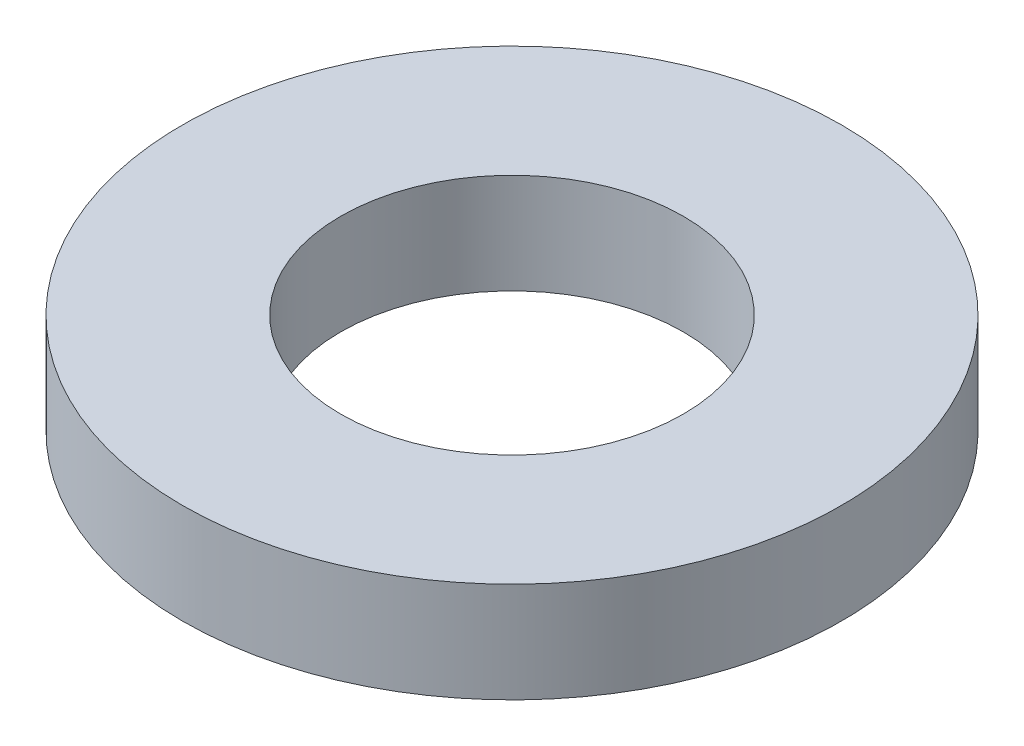
ISO-10303-21;
HEADER;
FILE_DESCRIPTION(('STEP AP214'),'2;1');
FILE_NAME('part.step','',(''),(''),'','','');
FILE_SCHEMA(('AUTOMOTIVE_DESIGN { 1 0 10303 214 1 1 1 1 }'));
ENDSEC;
DATA;
#1=APPLICATION_CONTEXT('core data for automotive mechanical design processes');
#2=APPLICATION_PROTOCOL_DEFINITION('international standard','automotive_design',2000,#1);
#3=PRODUCT_CONTEXT('',#1,'mechanical');
#4=PRODUCT('Part','Part','',(#3));
#5=PRODUCT_RELATED_PRODUCT_CATEGORY('part','',(#4));
#6=PRODUCT_DEFINITION_FORMATION('','',#4);
#7=PRODUCT_DEFINITION_CONTEXT('part definition',#1,'design');
#8=PRODUCT_DEFINITION('design','',#6,#7);
#9=PRODUCT_DEFINITION_SHAPE('','',#8);
#10=(LENGTH_UNIT() NAMED_UNIT(*) SI_UNIT(.MILLI.,.METRE.));
#11=(NAMED_UNIT(*) PLANE_ANGLE_UNIT() SI_UNIT($,.RADIAN.));
#12=(NAMED_UNIT(*) SI_UNIT($,.STERADIAN.) SOLID_ANGLE_UNIT());
#13=UNCERTAINTY_MEASURE_WITH_UNIT(LENGTH_MEASURE(1.E-05),#10,'distance_accuracy_value','');
#14=(GEOMETRIC_REPRESENTATION_CONTEXT(3) GLOBAL_UNCERTAINTY_ASSIGNED_CONTEXT((#13)) GLOBAL_UNIT_ASSIGNED_CONTEXT((#10,
#11,#12)) REPRESENTATION_CONTEXT('',''));
#15=CARTESIAN_POINT('',(0.,0.,0.));
#16=DIRECTION('',(0.,0.,1.));
#17=DIRECTION('',(1.,0.,0.));
#18=AXIS2_PLACEMENT_3D('',#15,#16,#17);
#19=CARTESIAN_POINT('',(0.,19.,0.));
#20=DIRECTION('',(0.,-1.,0.));
#21=DIRECTION('',(0.,0.,-1.));
#22=AXIS2_PLACEMENT_3D('',#19,#20,#21);
#23=CYLINDRICAL_SURFACE('',#22,62.5);
#24=CARTESIAN_POINT('',(0.,19.,0.));
#25=DIRECTION('',(0.,1.,0.));
#26=DIRECTION('',(0.,0.,1.));
#27=AXIS2_PLACEMENT_3D('',#24,#25,#26);
#28=CIRCLE('',#27,62.5);
#29=CARTESIAN_POINT('',(0.,19.,62.5));
#30=VERTEX_POINT('',#29);
#31=EDGE_CURVE('E10',#30,#30,#28,.T.);
#32=ORIENTED_EDGE('',*,*,#31,.F.);
#33=EDGE_LOOP('',(#32));
#34=FACE_BOUND('',#33,.T.);
#35=CARTESIAN_POINT('',(0.,0.,0.));
#36=DIRECTION('',(0.,1.,0.));
#37=DIRECTION('',(0.,0.,1.));
#38=AXIS2_PLACEMENT_3D('',#35,#36,#37);
#39=CIRCLE('',#38,62.5);
#40=CARTESIAN_POINT('',(0.,0.,62.5));
#41=VERTEX_POINT('',#40);
#42=EDGE_CURVE('E37',#41,#41,#39,.T.);
#43=ORIENTED_EDGE('',*,*,#42,.T.);
#44=EDGE_LOOP('',(#43));
#45=FACE_BOUND('',#44,.T.);
#46=ADVANCED_FACE('F40',(#34,#45),#23,.T.);
#47=CARTESIAN_POINT('',(0.,19.,0.));
#48=DIRECTION('',(0.,1.,0.));
#49=DIRECTION('',(0.,0.,1.));
#50=AXIS2_PLACEMENT_3D('',#47,#48,#49);
#51=PLANE('',#50);
#52=CARTESIAN_POINT('',(0.,19.,0.));
#53=DIRECTION('',(0.,1.,0.));
#54=DIRECTION('',(0.,0.,1.));
#55=AXIS2_PLACEMENT_3D('',#52,#53,#54);
#56=CIRCLE('',#55,32.5);
#57=CARTESIAN_POINT('',(0.,19.,32.5));
#58=VERTEX_POINT('',#57);
#59=EDGE_CURVE('E50',#58,#58,#56,.T.);
#60=ORIENTED_EDGE('',*,*,#59,.F.);
#61=EDGE_LOOP('',(#60));
#62=FACE_BOUND('',#61,.T.);
#63=ORIENTED_EDGE('',*,*,#31,.T.);
#64=EDGE_LOOP('',(#63));
#65=FACE_BOUND('',#64,.T.);
#66=ADVANCED_FACE('F59',(#62,#65),#51,.T.);
#67=CARTESIAN_POINT('',(0.,0.,0.));
#68=DIRECTION('',(0.,1.,0.));
#69=DIRECTION('',(0.,0.,1.));
#70=AXIS2_PLACEMENT_3D('',#67,#68,#69);
#71=PLANE('',#70);
#72=CARTESIAN_POINT('',(0.,0.,0.));
#73=DIRECTION('',(0.,1.,0.));
#74=DIRECTION('',(0.,0.,1.));
#75=AXIS2_PLACEMENT_3D('',#72,#73,#74);
#76=CIRCLE('',#75,32.5);
#77=CARTESIAN_POINT('',(0.,0.,32.5));
#78=VERTEX_POINT('',#77);
#79=EDGE_CURVE('E47',#78,#78,#76,.T.);
#80=ORIENTED_EDGE('',*,*,#79,.T.);
#81=EDGE_LOOP('',(#80));
#82=FACE_BOUND('',#81,.T.);
#83=ORIENTED_EDGE('',*,*,#42,.F.);
#84=EDGE_LOOP('',(#83));
#85=FACE_BOUND('',#84,.T.);
#86=ADVANCED_FACE('F58',(#82,#85),#71,.F.);
#87=CARTESIAN_POINT('',(0.,19.,0.));
#88=DIRECTION('',(0.,-1.,0.));
#89=DIRECTION('',(0.,0.,-1.));
#90=AXIS2_PLACEMENT_3D('',#87,#88,#89);
#91=CYLINDRICAL_SURFACE('',#90,32.5);
#92=ORIENTED_EDGE('',*,*,#59,.T.);
#93=EDGE_LOOP('',(#92));
#94=FACE_BOUND('',#93,.T.);
#95=ORIENTED_EDGE('',*,*,#79,.F.);
#96=EDGE_LOOP('',(#95));
#97=FACE_BOUND('',#96,.T.);
#98=ADVANCED_FACE('F54',(#94,#97),#91,.F.);
#99=CLOSED_SHELL('',(#46,#66,#86,#98));
#100=MANIFOLD_SOLID_BREP('B2',#99);
#101=ADVANCED_BREP_SHAPE_REPRESENTATION('',(#18,#100),#14);
#102=SHAPE_DEFINITION_REPRESENTATION(#9,#101);
ENDSEC;
END-ISO-10303-21;
